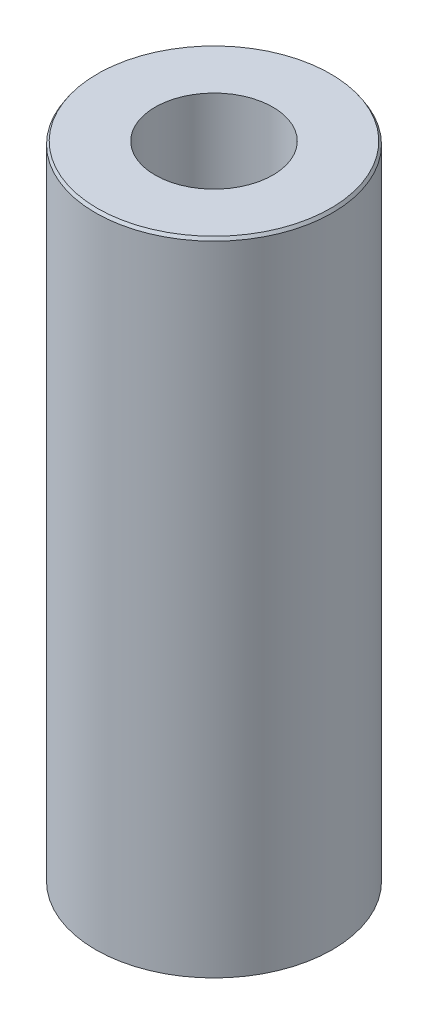
ISO-10303-21;
HEADER;
FILE_DESCRIPTION(('STEP AP214'),'2;1');
FILE_NAME('part.step','',(''),(''),'','','');
FILE_SCHEMA(('AUTOMOTIVE_DESIGN { 1 0 10303 214 1 1 1 1 }'));
ENDSEC;
DATA;
#1=APPLICATION_CONTEXT('core data for automotive mechanical design processes');
#2=APPLICATION_PROTOCOL_DEFINITION('international standard','automotive_design',2000,#1);
#3=PRODUCT_CONTEXT('',#1,'mechanical');
#4=PRODUCT('Part','Part','',(#3));
#5=PRODUCT_RELATED_PRODUCT_CATEGORY('part','',(#4));
#6=PRODUCT_DEFINITION_FORMATION('','',#4);
#7=PRODUCT_DEFINITION_CONTEXT('part definition',#1,'design');
#8=PRODUCT_DEFINITION('design','',#6,#7);
#9=PRODUCT_DEFINITION_SHAPE('','',#8);
#10=(LENGTH_UNIT() NAMED_UNIT(*) SI_UNIT(.MILLI.,.METRE.));
#11=(NAMED_UNIT(*) PLANE_ANGLE_UNIT() SI_UNIT($,.RADIAN.));
#12=(NAMED_UNIT(*) SI_UNIT($,.STERADIAN.) SOLID_ANGLE_UNIT());
#13=UNCERTAINTY_MEASURE_WITH_UNIT(LENGTH_MEASURE(1.E-05),#10,'distance_accuracy_value','');
#14=(GEOMETRIC_REPRESENTATION_CONTEXT(3) GLOBAL_UNCERTAINTY_ASSIGNED_CONTEXT((#13)) GLOBAL_UNIT_ASSIGNED_CONTEXT((#10,
#11,#12)) REPRESENTATION_CONTEXT('',''));
#15=CARTESIAN_POINT('',(0.,0.,0.));
#16=DIRECTION('',(0.,0.,1.));
#17=DIRECTION('',(1.,0.,0.));
#18=AXIS2_PLACEMENT_3D('',#15,#16,#17);
#19=CARTESIAN_POINT('',(0.,271.383393234813,0.));
#20=DIRECTION('',(0.,-1.,0.));
#21=DIRECTION('',(0.,0.,-1.));
#22=AXIS2_PLACEMENT_3D('',#19,#20,#21);
#23=CYLINDRICAL_SURFACE('',#22,50.);
#24=CARTESIAN_POINT('',(0.,270.144112969826,0.));
#25=DIRECTION('',(0.,1.,0.));
#26=DIRECTION('',(0.,0.,1.));
#27=AXIS2_PLACEMENT_3D('',#24,#25,#26);
#28=CIRCLE('',#27,50.);
#29=CARTESIAN_POINT('',(0.,270.144112969826,50.));
#30=VERTEX_POINT('',#29);
#31=EDGE_CURVE('E50',#30,#30,#28,.F.);
#32=ORIENTED_EDGE('',*,*,#31,.T.);
#33=EDGE_LOOP('',(#32));
#34=FACE_BOUND('',#33,.T.);
#35=CARTESIAN_POINT('',(0.,0.801640604385478,0.));
#36=DIRECTION('',(0.,1.,0.));
#37=DIRECTION('',(0.,0.,1.));
#38=AXIS2_PLACEMENT_3D('',#35,#36,#37);
#39=CIRCLE('',#38,50.);
#40=CARTESIAN_POINT('',(0.,0.801640604385478,50.));
#41=VERTEX_POINT('',#40);
#42=EDGE_CURVE('E51',#41,#41,#39,.T.);
#43=ORIENTED_EDGE('',*,*,#42,.T.);
#44=EDGE_LOOP('',(#43));
#45=FACE_BOUND('',#44,.T.);
#46=ADVANCED_FACE('F39',(#34,#45),#23,.T.);
#47=CARTESIAN_POINT('',(0.,271.383393234813,0.));
#48=DIRECTION('',(0.,1.,0.));
#49=DIRECTION('',(0.,0.,1.));
#50=AXIS2_PLACEMENT_3D('',#47,#48,#49);
#51=PLANE('',#50);
#52=CARTESIAN_POINT('',(0.,271.383393234813,0.));
#53=DIRECTION('',(0.,1.,0.));
#54=DIRECTION('',(0.,0.,1.));
#55=AXIS2_PLACEMENT_3D('',#52,#53,#54);
#56=CIRCLE('',#55,49.1983593956145);
#57=CARTESIAN_POINT('',(0.,271.383393234813,49.1983593956145));
#58=VERTEX_POINT('',#57);
#59=EDGE_CURVE('E54',#58,#58,#56,.T.);
#60=ORIENTED_EDGE('',*,*,#59,.T.);
#61=EDGE_LOOP('',(#60));
#62=FACE_BOUND('',#61,.T.);
#63=CARTESIAN_POINT('',(0.,271.383393234813,0.));
#64=DIRECTION('',(0.,1.,0.));
#65=DIRECTION('',(0.,0.,1.));
#66=AXIS2_PLACEMENT_3D('',#63,#64,#65);
#67=CIRCLE('',#66,24.8638540549354);
#68=CARTESIAN_POINT('',(0.,271.383393234813,24.8638540549354));
#69=VERTEX_POINT('',#68);
#70=EDGE_CURVE('E58',#69,#69,#67,.T.);
#71=ORIENTED_EDGE('',*,*,#70,.F.);
#72=EDGE_LOOP('',(#71));
#73=FACE_BOUND('',#72,.T.);
#74=ADVANCED_FACE('F69',(#62,#73),#51,.T.);
#75=CARTESIAN_POINT('',(0.,0.,0.));
#76=DIRECTION('',(0.,1.,0.));
#77=DIRECTION('',(0.,0.,1.));
#78=AXIS2_PLACEMENT_3D('',#75,#76,#77);
#79=PLANE('',#78);
#80=CARTESIAN_POINT('',(0.,0.,0.));
#81=DIRECTION('',(0.,1.,0.));
#82=DIRECTION('',(0.,0.,1.));
#83=AXIS2_PLACEMENT_3D('',#80,#81,#82);
#84=CIRCLE('',#83,48.760719735013);
#85=CARTESIAN_POINT('',(0.,0.,48.760719735013));
#86=VERTEX_POINT('',#85);
#87=EDGE_CURVE('E10',#86,#86,#84,.F.);
#88=ORIENTED_EDGE('',*,*,#87,.T.);
#89=EDGE_LOOP('',(#88));
#90=FACE_BOUND('',#89,.T.);
#91=CARTESIAN_POINT('',(0.,0.,0.));
#92=DIRECTION('',(0.,1.,0.));
#93=DIRECTION('',(0.,0.,1.));
#94=AXIS2_PLACEMENT_3D('',#91,#92,#93);
#95=CIRCLE('',#94,24.8638540549354);
#96=CARTESIAN_POINT('',(0.,0.,24.8638540549354));
#97=VERTEX_POINT('',#96);
#98=EDGE_CURVE('E63',#97,#97,#95,.T.);
#99=ORIENTED_EDGE('',*,*,#98,.T.);
#100=EDGE_LOOP('',(#99));
#101=FACE_BOUND('',#100,.T.);
#102=ADVANCED_FACE('F75',(#90,#101),#79,.F.);
#103=CARTESIAN_POINT('',(0.,271.383393234813,0.));
#104=DIRECTION('',(0.,-1.,0.));
#105=DIRECTION('',(0.,0.,-1.));
#106=AXIS2_PLACEMENT_3D('',#103,#104,#105);
#107=CYLINDRICAL_SURFACE('',#106,24.8638540549354);
#108=ORIENTED_EDGE('',*,*,#70,.T.);
#109=EDGE_LOOP('',(#108));
#110=FACE_BOUND('',#109,.T.);
#111=ORIENTED_EDGE('',*,*,#98,.F.);
#112=EDGE_LOOP('',(#111));
#113=FACE_BOUND('',#112,.T.);
#114=ADVANCED_FACE('F70',(#110,#113),#107,.F.);
#115=CARTESIAN_POINT('',(0.,271.383393234813,0.));
#116=DIRECTION('',(0.,-1.,0.));
#117=DIRECTION('',(0.,0.,-1.));
#118=AXIS2_PLACEMENT_3D('',#115,#116,#117);
#119=CONICAL_SURFACE('',#118,49.1983593956145,0.57416454151882);
#120=ORIENTED_EDGE('',*,*,#31,.F.);
#121=EDGE_LOOP('',(#120));
#122=FACE_BOUND('',#121,.T.);
#123=ORIENTED_EDGE('',*,*,#59,.F.);
#124=EDGE_LOOP('',(#123));
#125=FACE_BOUND('',#124,.T.);
#126=ADVANCED_FACE('F81',(#122,#125),#119,.T.);
#127=CARTESIAN_POINT('',(0.,0.801640604385478,0.));
#128=DIRECTION('',(0.,1.,0.));
#129=DIRECTION('',(0.,0.,1.));
#130=AXIS2_PLACEMENT_3D('',#127,#128,#129);
#131=CONICAL_SURFACE('',#130,50.,0.996631785276079);
#132=ORIENTED_EDGE('',*,*,#87,.F.);
#133=EDGE_LOOP('',(#132));
#134=FACE_BOUND('',#133,.T.);
#135=ORIENTED_EDGE('',*,*,#42,.F.);
#136=EDGE_LOOP('',(#135));
#137=FACE_BOUND('',#136,.T.);
#138=ADVANCED_FACE('F45',(#134,#137),#131,.T.);
#139=CLOSED_SHELL('',(#46,#74,#102,#114,#126,#138));
#140=MANIFOLD_SOLID_BREP('B2',#139);
#141=ADVANCED_BREP_SHAPE_REPRESENTATION('',(#18,#140),#14);
#142=SHAPE_DEFINITION_REPRESENTATION(#9,#141);
ENDSEC;
END-ISO-10303-21;
